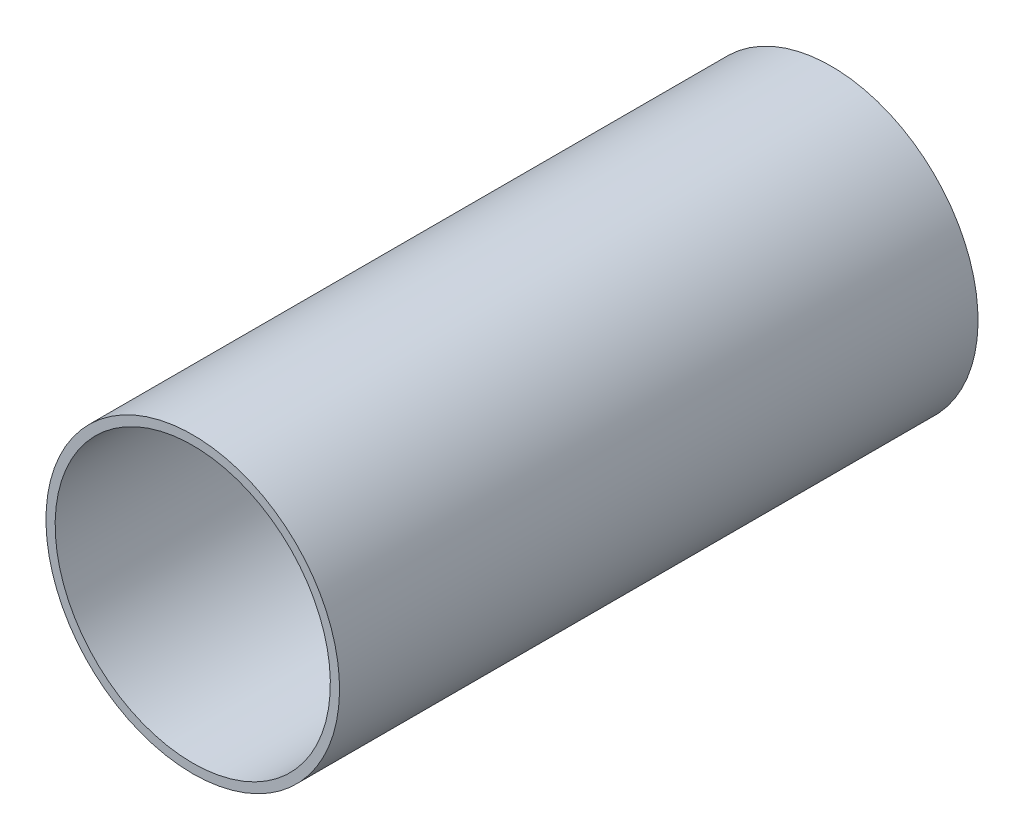
ISO-10303-21;
HEADER;
FILE_DESCRIPTION(('STEP AP214'),'2;1');
FILE_NAME('part.step','',(''),(''),'','','');
FILE_SCHEMA(('AUTOMOTIVE_DESIGN { 1 0 10303 214 1 1 1 1 }'));
ENDSEC;
DATA;
#1=APPLICATION_CONTEXT('core data for automotive mechanical design processes');
#2=APPLICATION_PROTOCOL_DEFINITION('international standard','automotive_design',2000,#1);
#3=PRODUCT_CONTEXT('',#1,'mechanical');
#4=PRODUCT('Part','Part','',(#3));
#5=PRODUCT_RELATED_PRODUCT_CATEGORY('part','',(#4));
#6=PRODUCT_DEFINITION_FORMATION('','',#4);
#7=PRODUCT_DEFINITION_CONTEXT('part definition',#1,'design');
#8=PRODUCT_DEFINITION('design','',#6,#7);
#9=PRODUCT_DEFINITION_SHAPE('','',#8);
#10=(LENGTH_UNIT() NAMED_UNIT(*) SI_UNIT(.MILLI.,.METRE.));
#11=(NAMED_UNIT(*) PLANE_ANGLE_UNIT() SI_UNIT($,.RADIAN.));
#12=(NAMED_UNIT(*) SI_UNIT($,.STERADIAN.) SOLID_ANGLE_UNIT());
#13=UNCERTAINTY_MEASURE_WITH_UNIT(LENGTH_MEASURE(1.E-05),#10,'distance_accuracy_value','');
#14=(GEOMETRIC_REPRESENTATION_CONTEXT(3) GLOBAL_UNCERTAINTY_ASSIGNED_CONTEXT((#13)) GLOBAL_UNIT_ASSIGNED_CONTEXT((#10,
#11,#12)) REPRESENTATION_CONTEXT('',''));
#15=CARTESIAN_POINT('',(0.,0.,0.));
#16=DIRECTION('',(0.,0.,1.));
#17=DIRECTION('',(1.,0.,0.));
#18=AXIS2_PLACEMENT_3D('',#15,#16,#17);
#19=CARTESIAN_POINT('',(160.02,-80.772,-0.045));
#20=DIRECTION('',(0.,0.,-1.));
#21=DIRECTION('',(0.,-1.,0.));
#22=AXIS2_PLACEMENT_3D('',#19,#20,#21);
#23=CYLINDRICAL_SURFACE('',#22,0.375);
#24=CARTESIAN_POINT('',(160.02,-80.772,-0.035));
#25=DIRECTION('',(0.,0.,-1.));
#26=DIRECTION('',(0.,-1.,0.));
#27=AXIS2_PLACEMENT_3D('',#24,#25,#26);
#28=CIRCLE('',#27,0.375);
#29=CARTESIAN_POINT('',(160.02,-81.147,-0.035));
#30=VERTEX_POINT('',#29);
#31=EDGE_CURVE('E65',#30,#30,#28,.T.);
#32=ORIENTED_EDGE('',*,*,#31,.T.);
#33=DIRECTION('',(0.,0.,1.));
#34=VECTOR('',#33,1.);
#35=CARTESIAN_POINT('',(160.02,-81.147,-0.045));
#36=LINE('',#35,#34);
#37=CARTESIAN_POINT('',(160.02,-81.147,1.705));
#38=VERTEX_POINT('',#37);
#39=EDGE_CURVE('E11',#30,#38,#36,.T.);
#40=ORIENTED_EDGE('',*,*,#39,.T.);
#41=CARTESIAN_POINT('',(160.02,-80.772,1.705));
#42=DIRECTION('',(0.,0.,-1.));
#43=DIRECTION('',(0.,-1.,0.));
#44=AXIS2_PLACEMENT_3D('',#41,#42,#43);
#45=CIRCLE('',#44,0.375);
#46=EDGE_CURVE('E26',#38,#38,#45,.T.);
#47=ORIENTED_EDGE('',*,*,#46,.F.);
#48=ORIENTED_EDGE('',*,*,#39,.F.);
#49=EDGE_LOOP('',(#32,#40,#47,#48));
#50=FACE_BOUND('',#49,.T.);
#51=ADVANCED_FACE('F17',(#50),#23,.F.);
#52=CARTESIAN_POINT('',(160.02,-81.172,1.705));
#53=DIRECTION('',(0.,0.,1.));
#54=DIRECTION('',(1.,0.,0.));
#55=AXIS2_PLACEMENT_3D('',#52,#53,#54);
#56=PLANE('',#55);
#57=ORIENTED_EDGE('',*,*,#46,.T.);
#58=EDGE_LOOP('',(#57));
#59=FACE_BOUND('',#58,.T.);
#60=CARTESIAN_POINT('',(160.02,-80.772,1.705));
#61=DIRECTION('',(0.,0.,1.));
#62=DIRECTION('',(0.,-1.,0.));
#63=AXIS2_PLACEMENT_3D('',#60,#61,#62);
#64=CIRCLE('',#63,0.4);
#65=CARTESIAN_POINT('',(160.02,-81.172,1.705));
#66=VERTEX_POINT('',#65);
#67=EDGE_CURVE('E57',#66,#66,#64,.T.);
#68=ORIENTED_EDGE('',*,*,#67,.T.);
#69=EDGE_LOOP('',(#68));
#70=FACE_BOUND('',#69,.T.);
#71=ADVANCED_FACE('F19',(#59,#70),#56,.T.);
#72=CARTESIAN_POINT('',(160.02,-81.172,-0.035));
#73=DIRECTION('',(0.,0.,1.));
#74=DIRECTION('',(1.,0.,0.));
#75=AXIS2_PLACEMENT_3D('',#72,#73,#74);
#76=PLANE('',#75);
#77=ORIENTED_EDGE('',*,*,#31,.F.);
#78=EDGE_LOOP('',(#77));
#79=FACE_BOUND('',#78,.T.);
#80=CARTESIAN_POINT('',(160.02,-80.772,-0.035));
#81=DIRECTION('',(0.,0.,1.));
#82=DIRECTION('',(0.,-1.,0.));
#83=AXIS2_PLACEMENT_3D('',#80,#81,#82);
#84=CIRCLE('',#83,0.4);
#85=CARTESIAN_POINT('',(160.02,-81.172,-0.035));
#86=VERTEX_POINT('',#85);
#87=EDGE_CURVE('E56',#86,#86,#84,.T.);
#88=ORIENTED_EDGE('',*,*,#87,.F.);
#89=EDGE_LOOP('',(#88));
#90=FACE_BOUND('',#89,.T.);
#91=ADVANCED_FACE('F83',(#79,#90),#76,.F.);
#92=CARTESIAN_POINT('',(160.02,-80.772,-0.035));
#93=DIRECTION('',(0.,0.,-1.));
#94=DIRECTION('',(0.,-1.,0.));
#95=AXIS2_PLACEMENT_3D('',#92,#93,#94);
#96=CYLINDRICAL_SURFACE('',#95,0.4);
#97=ORIENTED_EDGE('',*,*,#87,.T.);
#98=DIRECTION('',(0.,0.,1.));
#99=VECTOR('',#98,1.);
#100=CARTESIAN_POINT('',(160.02,-81.172,-0.035));
#101=LINE('',#100,#99);
#102=EDGE_CURVE('E53',#86,#66,#101,.T.);
#103=ORIENTED_EDGE('',*,*,#102,.T.);
#104=ORIENTED_EDGE('',*,*,#67,.F.);
#105=ORIENTED_EDGE('',*,*,#102,.F.);
#106=EDGE_LOOP('',(#97,#103,#104,#105));
#107=FACE_BOUND('',#106,.T.);
#108=ADVANCED_FACE('F54',(#107),#96,.T.);
#109=CLOSED_SHELL('',(#51,#71,#91,#108));
#110=MANIFOLD_SOLID_BREP('B1',#109);
#111=ADVANCED_BREP_SHAPE_REPRESENTATION('',(#18,#110),#14);
#112=SHAPE_DEFINITION_REPRESENTATION(#9,#111);
ENDSEC;
END-ISO-10303-21;
